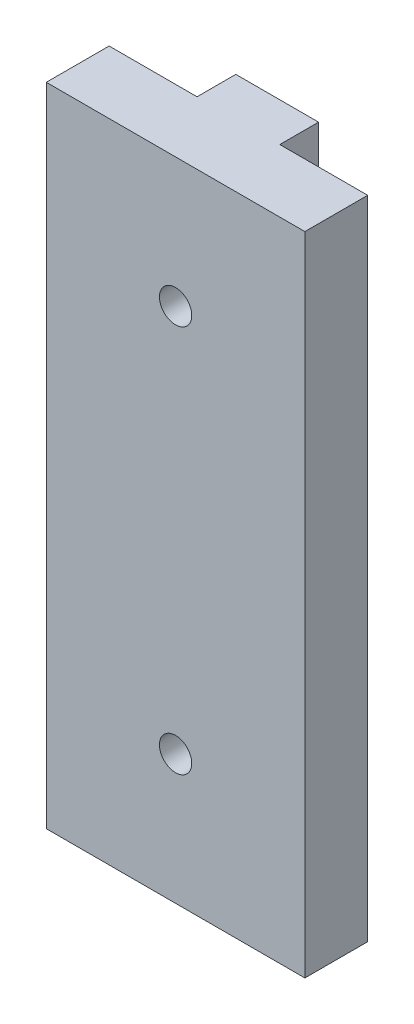
ISO-10303-21;
HEADER;
FILE_DESCRIPTION(('STEP AP214'),'2;1');
FILE_NAME('part.step','',(''),(''),'','','');
FILE_SCHEMA(('AUTOMOTIVE_DESIGN { 1 0 10303 214 1 1 1 1 }'));
ENDSEC;
DATA;
#1=APPLICATION_CONTEXT('core data for automotive mechanical design processes');
#2=APPLICATION_PROTOCOL_DEFINITION('international standard','automotive_design',2000,#1);
#3=PRODUCT_CONTEXT('',#1,'mechanical');
#4=PRODUCT('Part','Part','',(#3));
#5=PRODUCT_RELATED_PRODUCT_CATEGORY('part','',(#4));
#6=PRODUCT_DEFINITION_FORMATION('','',#4);
#7=PRODUCT_DEFINITION_CONTEXT('part definition',#1,'design');
#8=PRODUCT_DEFINITION('design','',#6,#7);
#9=PRODUCT_DEFINITION_SHAPE('','',#8);
#10=(LENGTH_UNIT() NAMED_UNIT(*) SI_UNIT(.MILLI.,.METRE.));
#11=(NAMED_UNIT(*) PLANE_ANGLE_UNIT() SI_UNIT($,.RADIAN.));
#12=(NAMED_UNIT(*) SI_UNIT($,.STERADIAN.) SOLID_ANGLE_UNIT());
#13=UNCERTAINTY_MEASURE_WITH_UNIT(LENGTH_MEASURE(1.E-05),#10,'distance_accuracy_value','');
#14=(GEOMETRIC_REPRESENTATION_CONTEXT(3) GLOBAL_UNCERTAINTY_ASSIGNED_CONTEXT((#13)) GLOBAL_UNIT_ASSIGNED_CONTEXT((#10,
#11,#12)) REPRESENTATION_CONTEXT('',''));
#15=CARTESIAN_POINT('',(0.,0.,0.));
#16=DIRECTION('',(0.,0.,1.));
#17=DIRECTION('',(1.,0.,0.));
#18=AXIS2_PLACEMENT_3D('',#15,#16,#17);
#19=CARTESIAN_POINT('',(0.,63.5,0.));
#20=DIRECTION('',(1.,0.,0.));
#21=DIRECTION('',(0.,0.,-1.));
#22=AXIS2_PLACEMENT_3D('',#19,#20,#21);
#23=PLANE('',#22);
#24=DIRECTION('',(0.,0.,1.));
#25=VECTOR('',#24,1.);
#26=CARTESIAN_POINT('',(0.,0.,0.));
#27=LINE('',#26,#25);
#28=CARTESIAN_POINT('',(0.,0.,-6.1722));
#29=VERTEX_POINT('',#28);
#30=CARTESIAN_POINT('',(0.,0.,0.));
#31=VERTEX_POINT('',#30);
#32=EDGE_CURVE('E142',#29,#31,#27,.T.);
#33=ORIENTED_EDGE('',*,*,#32,.T.);
#34=DIRECTION('',(0.,-1.,0.));
#35=VECTOR('',#34,1.);
#36=CARTESIAN_POINT('',(0.,63.5,0.));
#37=LINE('',#36,#35);
#38=CARTESIAN_POINT('',(0.,63.5,0.));
#39=VERTEX_POINT('',#38);
#40=EDGE_CURVE('E11',#39,#31,#37,.T.);
#41=ORIENTED_EDGE('',*,*,#40,.F.);
#42=DIRECTION('',(0.,0.,1.));
#43=VECTOR('',#42,1.);
#44=CARTESIAN_POINT('',(0.,63.5,0.));
#45=LINE('',#44,#43);
#46=CARTESIAN_POINT('',(0.,63.5,-6.1722));
#47=VERTEX_POINT('',#46);
#48=EDGE_CURVE('E164',#47,#39,#45,.T.);
#49=ORIENTED_EDGE('',*,*,#48,.F.);
#50=DIRECTION('',(0.,-1.,0.));
#51=VECTOR('',#50,1.);
#52=CARTESIAN_POINT('',(0.,63.5,-6.1722));
#53=LINE('',#52,#51);
#54=EDGE_CURVE('E138',#47,#29,#53,.T.);
#55=ORIENTED_EDGE('',*,*,#54,.T.);
#56=EDGE_LOOP('',(#33,#41,#49,#55));
#57=FACE_BOUND('',#56,.T.);
#58=ADVANCED_FACE('F39',(#57),#23,.F.);
#59=CARTESIAN_POINT('',(0.,63.5,0.));
#60=DIRECTION('',(0.,0.,-1.));
#61=DIRECTION('',(-1.,0.,0.));
#62=AXIS2_PLACEMENT_3D('',#59,#60,#61);
#63=PLANE('',#62);
#64=CARTESIAN_POINT('',(12.7,50.8,0.));
#65=DIRECTION('',(0.,0.,1.));
#66=DIRECTION('',(1.,0.,0.));
#67=AXIS2_PLACEMENT_3D('',#64,#65,#66);
#68=CIRCLE('',#67,1.5875);
#69=CARTESIAN_POINT('',(14.2875,50.8,0.));
#70=VERTEX_POINT('',#69);
#71=EDGE_CURVE('E184',#70,#70,#68,.T.);
#72=ORIENTED_EDGE('',*,*,#71,.F.);
#73=EDGE_LOOP('',(#72));
#74=FACE_BOUND('',#73,.T.);
#75=CARTESIAN_POINT('',(12.7,12.7,0.));
#76=DIRECTION('',(0.,0.,1.));
#77=DIRECTION('',(1.,0.,0.));
#78=AXIS2_PLACEMENT_3D('',#75,#76,#77);
#79=CIRCLE('',#78,1.5875);
#80=CARTESIAN_POINT('',(14.2875,12.7,0.));
#81=VERTEX_POINT('',#80);
#82=EDGE_CURVE('E191',#81,#81,#79,.T.);
#83=ORIENTED_EDGE('',*,*,#82,.F.);
#84=EDGE_LOOP('',(#83));
#85=FACE_BOUND('',#84,.T.);
#86=DIRECTION('',(1.,0.,0.));
#87=VECTOR('',#86,1.);
#88=CARTESIAN_POINT('',(0.,0.,0.));
#89=LINE('',#88,#87);
#90=CARTESIAN_POINT('',(25.4,0.,0.));
#91=VERTEX_POINT('',#90);
#92=EDGE_CURVE('E146',#31,#91,#89,.T.);
#93=ORIENTED_EDGE('',*,*,#92,.T.);
#94=DIRECTION('',(0.,-1.,0.));
#95=VECTOR('',#94,1.);
#96=CARTESIAN_POINT('',(25.4,63.5,0.));
#97=LINE('',#96,#95);
#98=CARTESIAN_POINT('',(25.4,63.5,0.));
#99=VERTEX_POINT('',#98);
#100=EDGE_CURVE('E49',#99,#91,#97,.T.);
#101=ORIENTED_EDGE('',*,*,#100,.F.);
#102=DIRECTION('',(1.,0.,0.));
#103=VECTOR('',#102,1.);
#104=CARTESIAN_POINT('',(0.,63.5,0.));
#105=LINE('',#104,#103);
#106=EDGE_CURVE('E101',#39,#99,#105,.T.);
#107=ORIENTED_EDGE('',*,*,#106,.F.);
#108=ORIENTED_EDGE('',*,*,#40,.T.);
#109=EDGE_LOOP('',(#93,#101,#107,#108));
#110=FACE_BOUND('',#109,.T.);
#111=ADVANCED_FACE('F237',(#74,#85,#110),#63,.F.);
#112=CARTESIAN_POINT('',(25.4,63.5,0.));
#113=DIRECTION('',(-1.,0.,0.));
#114=DIRECTION('',(0.,0.,1.));
#115=AXIS2_PLACEMENT_3D('',#112,#113,#114);
#116=PLANE('',#115);
#117=DIRECTION('',(0.,0.,-1.));
#118=VECTOR('',#117,1.);
#119=CARTESIAN_POINT('',(25.4,0.,0.));
#120=LINE('',#119,#118);
#121=CARTESIAN_POINT('',(25.4,0.,-6.1722));
#122=VERTEX_POINT('',#121);
#123=EDGE_CURVE('E149',#91,#122,#120,.T.);
#124=ORIENTED_EDGE('',*,*,#123,.T.);
#125=DIRECTION('',(0.,-1.,0.));
#126=VECTOR('',#125,1.);
#127=CARTESIAN_POINT('',(25.4,63.5,-6.1722));
#128=LINE('',#127,#126);
#129=CARTESIAN_POINT('',(25.4,63.5,-6.1722));
#130=VERTEX_POINT('',#129);
#131=EDGE_CURVE('E175',#130,#122,#128,.T.);
#132=ORIENTED_EDGE('',*,*,#131,.F.);
#133=DIRECTION('',(0.,0.,-1.));
#134=VECTOR('',#133,1.);
#135=CARTESIAN_POINT('',(25.4,63.5,0.));
#136=LINE('',#135,#134);
#137=EDGE_CURVE('E203',#99,#130,#136,.T.);
#138=ORIENTED_EDGE('',*,*,#137,.F.);
#139=ORIENTED_EDGE('',*,*,#100,.T.);
#140=EDGE_LOOP('',(#124,#132,#138,#139));
#141=FACE_BOUND('',#140,.T.);
#142=ADVANCED_FACE('F241',(#141),#116,.F.);
#143=CARTESIAN_POINT('',(16.764,63.5,-6.1722));
#144=DIRECTION('',(0.,0.,1.));
#145=DIRECTION('',(1.,0.,0.));
#146=AXIS2_PLACEMENT_3D('',#143,#144,#145);
#147=PLANE('',#146);
#148=DIRECTION('',(-1.,0.,0.));
#149=VECTOR('',#148,1.);
#150=CARTESIAN_POINT('',(16.764,0.,-6.1722));
#151=LINE('',#150,#149);
#152=CARTESIAN_POINT('',(16.764,0.,-6.1722));
#153=VERTEX_POINT('',#152);
#154=EDGE_CURVE('E152',#122,#153,#151,.T.);
#155=ORIENTED_EDGE('',*,*,#154,.T.);
#156=DIRECTION('',(0.,-1.,0.));
#157=VECTOR('',#156,1.);
#158=CARTESIAN_POINT('',(16.764,63.5,-6.1722));
#159=LINE('',#158,#157);
#160=CARTESIAN_POINT('',(16.764,63.5,-6.1722));
#161=VERTEX_POINT('',#160);
#162=EDGE_CURVE('E171',#161,#153,#159,.T.);
#163=ORIENTED_EDGE('',*,*,#162,.F.);
#164=DIRECTION('',(-1.,0.,0.));
#165=VECTOR('',#164,1.);
#166=CARTESIAN_POINT('',(16.764,63.5,-6.1722));
#167=LINE('',#166,#165);
#168=EDGE_CURVE('E206',#130,#161,#167,.T.);
#169=ORIENTED_EDGE('',*,*,#168,.F.);
#170=ORIENTED_EDGE('',*,*,#131,.T.);
#171=EDGE_LOOP('',(#155,#163,#169,#170));
#172=FACE_BOUND('',#171,.T.);
#173=ADVANCED_FACE('F214',(#172),#147,.F.);
#174=CARTESIAN_POINT('',(16.764,63.5,-6.1722));
#175=DIRECTION('',(-1.,0.,0.));
#176=DIRECTION('',(0.,0.,1.));
#177=AXIS2_PLACEMENT_3D('',#174,#175,#176);
#178=PLANE('',#177);
#179=DIRECTION('',(0.,0.,-1.));
#180=VECTOR('',#179,1.);
#181=CARTESIAN_POINT('',(16.764,0.,-6.1722));
#182=LINE('',#181,#180);
#183=CARTESIAN_POINT('',(16.764,0.,-9.9822));
#184=VERTEX_POINT('',#183);
#185=EDGE_CURVE('E155',#153,#184,#182,.T.);
#186=ORIENTED_EDGE('',*,*,#185,.T.);
#187=DIRECTION('',(0.,-1.,0.));
#188=VECTOR('',#187,1.);
#189=CARTESIAN_POINT('',(16.764,63.5,-9.9822));
#190=LINE('',#189,#188);
#191=CARTESIAN_POINT('',(16.764,63.5,-9.9822));
#192=VERTEX_POINT('',#191);
#193=EDGE_CURVE('E131',#192,#184,#190,.T.);
#194=ORIENTED_EDGE('',*,*,#193,.F.);
#195=DIRECTION('',(0.,0.,-1.));
#196=VECTOR('',#195,1.);
#197=CARTESIAN_POINT('',(16.764,63.5,-6.1722));
#198=LINE('',#197,#196);
#199=EDGE_CURVE('E120',#161,#192,#198,.T.);
#200=ORIENTED_EDGE('',*,*,#199,.F.);
#201=ORIENTED_EDGE('',*,*,#162,.T.);
#202=EDGE_LOOP('',(#186,#194,#200,#201));
#203=FACE_BOUND('',#202,.T.);
#204=ADVANCED_FACE('F218',(#203),#178,.F.);
#205=CARTESIAN_POINT('',(8.636,63.5,-9.9822));
#206=DIRECTION('',(0.,0.,1.));
#207=DIRECTION('',(1.,0.,0.));
#208=AXIS2_PLACEMENT_3D('',#205,#206,#207);
#209=PLANE('',#208);
#210=CARTESIAN_POINT('',(12.7,50.8,-9.9822));
#211=DIRECTION('',(0.,0.,1.));
#212=DIRECTION('',(1.,0.,0.));
#213=AXIS2_PLACEMENT_3D('',#210,#211,#212);
#214=CIRCLE('',#213,1.5875);
#215=CARTESIAN_POINT('',(14.2875,50.8,-9.9822));
#216=VERTEX_POINT('',#215);
#217=EDGE_CURVE('E42',#216,#216,#214,.T.);
#218=ORIENTED_EDGE('',*,*,#217,.T.);
#219=EDGE_LOOP('',(#218));
#220=FACE_BOUND('',#219,.T.);
#221=CARTESIAN_POINT('',(12.7,12.7,-9.9822));
#222=DIRECTION('',(0.,0.,1.));
#223=DIRECTION('',(1.,0.,0.));
#224=AXIS2_PLACEMENT_3D('',#221,#222,#223);
#225=CIRCLE('',#224,1.5875);
#226=CARTESIAN_POINT('',(14.2875,12.7,-9.9822));
#227=VERTEX_POINT('',#226);
#228=EDGE_CURVE('E181',#227,#227,#225,.T.);
#229=ORIENTED_EDGE('',*,*,#228,.T.);
#230=EDGE_LOOP('',(#229));
#231=FACE_BOUND('',#230,.T.);
#232=DIRECTION('',(-1.,0.,0.));
#233=VECTOR('',#232,1.);
#234=CARTESIAN_POINT('',(8.636,0.,-9.9822));
#235=LINE('',#234,#233);
#236=CARTESIAN_POINT('',(8.636,0.,-9.9822));
#237=VERTEX_POINT('',#236);
#238=EDGE_CURVE('E129',#184,#237,#235,.T.);
#239=ORIENTED_EDGE('',*,*,#238,.T.);
#240=DIRECTION('',(0.,-1.,0.));
#241=VECTOR('',#240,1.);
#242=CARTESIAN_POINT('',(8.636,63.5,-9.9822));
#243=LINE('',#242,#241);
#244=CARTESIAN_POINT('',(8.636,63.5,-9.9822));
#245=VERTEX_POINT('',#244);
#246=EDGE_CURVE('E126',#245,#237,#243,.T.);
#247=ORIENTED_EDGE('',*,*,#246,.F.);
#248=DIRECTION('',(-1.,0.,0.));
#249=VECTOR('',#248,1.);
#250=CARTESIAN_POINT('',(8.636,63.5,-9.9822));
#251=LINE('',#250,#249);
#252=EDGE_CURVE('E114',#192,#245,#251,.T.);
#253=ORIENTED_EDGE('',*,*,#252,.F.);
#254=ORIENTED_EDGE('',*,*,#193,.T.);
#255=EDGE_LOOP('',(#239,#247,#253,#254));
#256=FACE_BOUND('',#255,.T.);
#257=ADVANCED_FACE('F127',(#220,#231,#256),#209,.F.);
#258=CARTESIAN_POINT('',(8.636,63.5,-6.1722));
#259=DIRECTION('',(1.,0.,0.));
#260=DIRECTION('',(0.,0.,-1.));
#261=AXIS2_PLACEMENT_3D('',#258,#259,#260);
#262=PLANE('',#261);
#263=DIRECTION('',(0.,0.,1.));
#264=VECTOR('',#263,1.);
#265=CARTESIAN_POINT('',(8.636,0.,-6.1722));
#266=LINE('',#265,#264);
#267=CARTESIAN_POINT('',(8.636,0.,-6.1722));
#268=VERTEX_POINT('',#267);
#269=EDGE_CURVE('E87',#237,#268,#266,.T.);
#270=ORIENTED_EDGE('',*,*,#269,.T.);
#271=DIRECTION('',(0.,-1.,0.));
#272=VECTOR('',#271,1.);
#273=CARTESIAN_POINT('',(8.636,63.5,-6.1722));
#274=LINE('',#273,#272);
#275=CARTESIAN_POINT('',(8.636,63.5,-6.1722));
#276=VERTEX_POINT('',#275);
#277=EDGE_CURVE('E132',#276,#268,#274,.T.);
#278=ORIENTED_EDGE('',*,*,#277,.F.);
#279=DIRECTION('',(0.,0.,1.));
#280=VECTOR('',#279,1.);
#281=CARTESIAN_POINT('',(8.636,63.5,-6.1722));
#282=LINE('',#281,#280);
#283=EDGE_CURVE('E118',#245,#276,#282,.T.);
#284=ORIENTED_EDGE('',*,*,#283,.F.);
#285=ORIENTED_EDGE('',*,*,#246,.T.);
#286=EDGE_LOOP('',(#270,#278,#284,#285));
#287=FACE_BOUND('',#286,.T.);
#288=ADVANCED_FACE('F134',(#287),#262,.F.);
#289=CARTESIAN_POINT('',(0.,63.5,-6.1722));
#290=DIRECTION('',(0.,0.,1.));
#291=DIRECTION('',(1.,0.,0.));
#292=AXIS2_PLACEMENT_3D('',#289,#290,#291);
#293=PLANE('',#292);
#294=DIRECTION('',(-1.,0.,0.));
#295=VECTOR('',#294,1.);
#296=CARTESIAN_POINT('',(0.,0.,-6.1722));
#297=LINE('',#296,#295);
#298=EDGE_CURVE('E93',#268,#29,#297,.T.);
#299=ORIENTED_EDGE('',*,*,#298,.T.);
#300=ORIENTED_EDGE('',*,*,#54,.F.);
#301=DIRECTION('',(-1.,0.,0.));
#302=VECTOR('',#301,1.);
#303=CARTESIAN_POINT('',(0.,63.5,-6.1722));
#304=LINE('',#303,#302);
#305=EDGE_CURVE('E58',#276,#47,#304,.T.);
#306=ORIENTED_EDGE('',*,*,#305,.F.);
#307=ORIENTED_EDGE('',*,*,#277,.T.);
#308=EDGE_LOOP('',(#299,#300,#306,#307));
#309=FACE_BOUND('',#308,.T.);
#310=ADVANCED_FACE('F226',(#309),#293,.F.);
#311=CARTESIAN_POINT('',(0.,63.5,0.));
#312=DIRECTION('',(0.,-1.,0.));
#313=DIRECTION('',(0.,0.,-1.));
#314=AXIS2_PLACEMENT_3D('',#311,#312,#313);
#315=PLANE('',#314);
#316=ORIENTED_EDGE('',*,*,#48,.T.);
#317=ORIENTED_EDGE('',*,*,#106,.T.);
#318=ORIENTED_EDGE('',*,*,#137,.T.);
#319=ORIENTED_EDGE('',*,*,#168,.T.);
#320=ORIENTED_EDGE('',*,*,#199,.T.);
#321=ORIENTED_EDGE('',*,*,#252,.T.);
#322=ORIENTED_EDGE('',*,*,#283,.T.);
#323=ORIENTED_EDGE('',*,*,#305,.T.);
#324=EDGE_LOOP('',(#316,#317,#318,#319,#320,#321,#322,#323));
#325=FACE_BOUND('',#324,.T.);
#326=ADVANCED_FACE('F116',(#325),#315,.F.);
#327=CARTESIAN_POINT('',(0.,0.,0.));
#328=DIRECTION('',(0.,-1.,0.));
#329=DIRECTION('',(0.,0.,-1.));
#330=AXIS2_PLACEMENT_3D('',#327,#328,#329);
#331=PLANE('',#330);
#332=ORIENTED_EDGE('',*,*,#32,.F.);
#333=ORIENTED_EDGE('',*,*,#298,.F.);
#334=ORIENTED_EDGE('',*,*,#269,.F.);
#335=ORIENTED_EDGE('',*,*,#238,.F.);
#336=ORIENTED_EDGE('',*,*,#185,.F.);
#337=ORIENTED_EDGE('',*,*,#154,.F.);
#338=ORIENTED_EDGE('',*,*,#123,.F.);
#339=ORIENTED_EDGE('',*,*,#92,.F.);
#340=EDGE_LOOP('',(#332,#333,#334,#335,#336,#337,#338,#339));
#341=FACE_BOUND('',#340,.T.);
#342=ADVANCED_FACE('F221',(#341),#331,.T.);
#343=CARTESIAN_POINT('',(12.7,12.7,-63.5));
#344=DIRECTION('',(0.,0.,1.));
#345=DIRECTION('',(1.,0.,0.));
#346=AXIS2_PLACEMENT_3D('',#343,#344,#345);
#347=CYLINDRICAL_SURFACE('',#346,1.5875);
#348=ORIENTED_EDGE('',*,*,#82,.T.);
#349=EDGE_LOOP('',(#348));
#350=FACE_BOUND('',#349,.T.);
#351=ORIENTED_EDGE('',*,*,#228,.F.);
#352=EDGE_LOOP('',(#351));
#353=FACE_BOUND('',#352,.T.);
#354=ADVANCED_FACE('F262',(#350,#353),#347,.F.);
#355=CARTESIAN_POINT('',(12.7,50.8,-63.5));
#356=DIRECTION('',(0.,0.,1.));
#357=DIRECTION('',(1.,0.,0.));
#358=AXIS2_PLACEMENT_3D('',#355,#356,#357);
#359=CYLINDRICAL_SURFACE('',#358,1.5875);
#360=ORIENTED_EDGE('',*,*,#71,.T.);
#361=EDGE_LOOP('',(#360));
#362=FACE_BOUND('',#361,.T.);
#363=ORIENTED_EDGE('',*,*,#217,.F.);
#364=EDGE_LOOP('',(#363));
#365=FACE_BOUND('',#364,.T.);
#366=ADVANCED_FACE('F260',(#362,#365),#359,.F.);
#367=CLOSED_SHELL('',(#58,#111,#142,#173,#204,#257,#288,#310,#326,#342,#354,#366));
#368=MANIFOLD_SOLID_BREP('B2',#367);
#369=ADVANCED_BREP_SHAPE_REPRESENTATION('',(#18,#368),#14);
#370=SHAPE_DEFINITION_REPRESENTATION(#9,#369);
ENDSEC;
END-ISO-10303-21;
